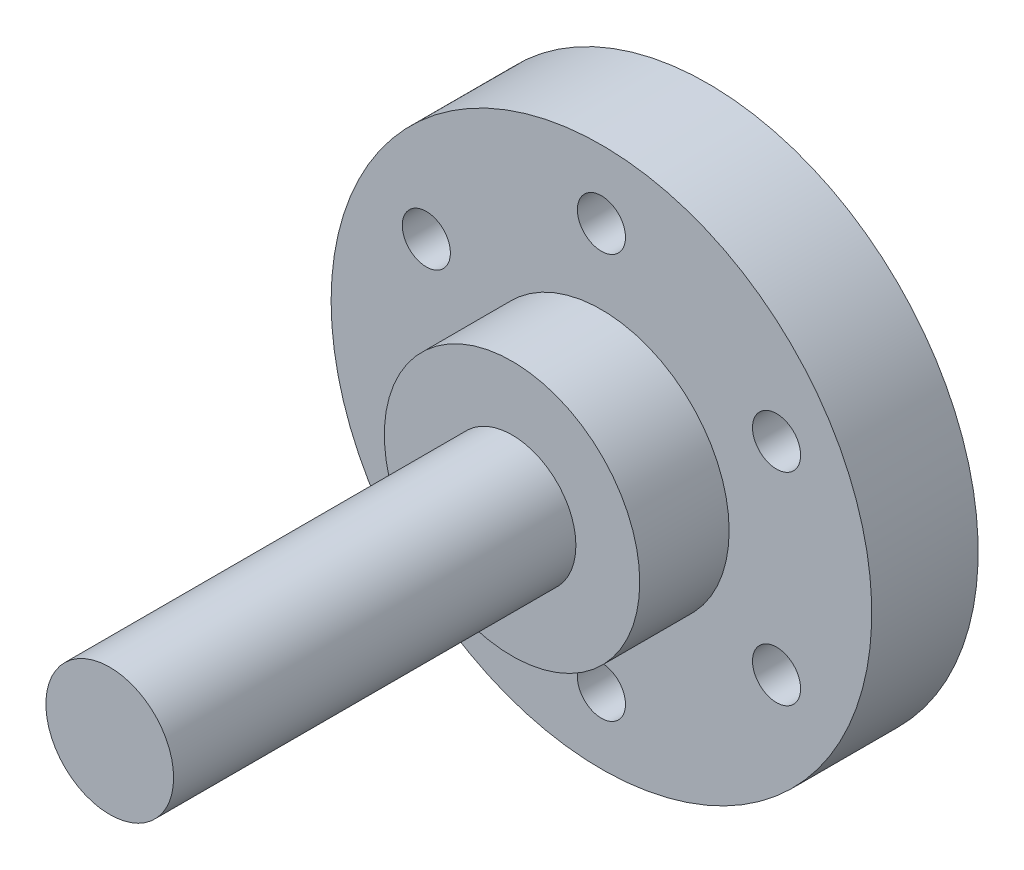
ISO-10303-21;
HEADER;
FILE_DESCRIPTION(('STEP AP214'),'2;1');
FILE_NAME('part.step','',(''),(''),'','','');
FILE_SCHEMA(('AUTOMOTIVE_DESIGN { 1 0 10303 214 1 1 1 1 }'));
ENDSEC;
DATA;
#1=APPLICATION_CONTEXT('core data for automotive mechanical design processes');
#2=APPLICATION_PROTOCOL_DEFINITION('international standard','automotive_design',2000,#1);
#3=PRODUCT_CONTEXT('',#1,'mechanical');
#4=PRODUCT('Part','Part','',(#3));
#5=PRODUCT_RELATED_PRODUCT_CATEGORY('part','',(#4));
#6=PRODUCT_DEFINITION_FORMATION('','',#4);
#7=PRODUCT_DEFINITION_CONTEXT('part definition',#1,'design');
#8=PRODUCT_DEFINITION('design','',#6,#7);
#9=PRODUCT_DEFINITION_SHAPE('','',#8);
#10=(LENGTH_UNIT() NAMED_UNIT(*) SI_UNIT(.MILLI.,.METRE.));
#11=(NAMED_UNIT(*) PLANE_ANGLE_UNIT() SI_UNIT($,.RADIAN.));
#12=(NAMED_UNIT(*) SI_UNIT($,.STERADIAN.) SOLID_ANGLE_UNIT());
#13=UNCERTAINTY_MEASURE_WITH_UNIT(LENGTH_MEASURE(1.E-05),#10,'distance_accuracy_value','');
#14=(GEOMETRIC_REPRESENTATION_CONTEXT(3) GLOBAL_UNCERTAINTY_ASSIGNED_CONTEXT((#13)) GLOBAL_UNIT_ASSIGNED_CONTEXT((#10,
#11,#12)) REPRESENTATION_CONTEXT('',''));
#15=CARTESIAN_POINT('',(0.,0.,0.));
#16=DIRECTION('',(0.,0.,1.));
#17=DIRECTION('',(1.,0.,0.));
#18=AXIS2_PLACEMENT_3D('',#15,#16,#17);
#19=CARTESIAN_POINT('',(0.,0.,5.9));
#20=DIRECTION('',(0.,0.,1.));
#21=DIRECTION('',(1.,0.,0.));
#22=AXIS2_PLACEMENT_3D('',#19,#20,#21);
#23=CYLINDRICAL_SURFACE('',#22,6.);
#24=CARTESIAN_POINT('',(0.,0.,5.9));
#25=DIRECTION('',(0.,0.,-1.));
#26=DIRECTION('',(-1.,0.,0.));
#27=AXIS2_PLACEMENT_3D('',#24,#25,#26);
#28=CIRCLE('',#27,6.);
#29=CARTESIAN_POINT('',(-6.,0.,5.9));
#30=VERTEX_POINT('',#29);
#31=EDGE_CURVE('E49',#30,#30,#28,.F.);
#32=ORIENTED_EDGE('',*,*,#31,.T.);
#33=EDGE_LOOP('',(#32));
#34=FACE_BOUND('',#33,.T.);
#35=CARTESIAN_POINT('',(0.,0.,10.1));
#36=DIRECTION('',(0.,0.,1.));
#37=DIRECTION('',(1.,0.,0.));
#38=AXIS2_PLACEMENT_3D('',#35,#36,#37);
#39=CIRCLE('',#38,6.);
#40=CARTESIAN_POINT('',(6.,0.,10.1));
#41=VERTEX_POINT('',#40);
#42=EDGE_CURVE('E58',#41,#41,#39,.T.);
#43=ORIENTED_EDGE('',*,*,#42,.F.);
#44=EDGE_LOOP('',(#43));
#45=FACE_BOUND('',#44,.T.);
#46=ADVANCED_FACE('F33',(#34,#45),#23,.T.);
#47=CARTESIAN_POINT('',(0.,0.,0.9));
#48=DIRECTION('',(0.,0.,-1.));
#49=DIRECTION('',(-1.,0.,0.));
#50=AXIS2_PLACEMENT_3D('',#47,#48,#49);
#51=PLANE('',#50);
#52=CARTESIAN_POINT('',(-8.22724133595237,4.75000000000035,0.899999999999998));
#53=DIRECTION('',(0.,0.,-1.));
#54=DIRECTION('',(-1.,0.,0.));
#55=AXIS2_PLACEMENT_3D('',#52,#53,#54);
#56=CIRCLE('',#55,1.13029999999999);
#57=CARTESIAN_POINT('',(-9.35754133595236,4.75000000000035,0.899999999999998));
#58=VERTEX_POINT('',#57);
#59=EDGE_CURVE('E170',#58,#58,#56,.T.);
#60=ORIENTED_EDGE('',*,*,#59,.F.);
#61=EDGE_LOOP('',(#60));
#62=FACE_BOUND('',#61,.T.);
#63=CARTESIAN_POINT('',(-8.22724133595277,-4.74999999999965,0.899999999999998));
#64=DIRECTION('',(0.,0.,-1.));
#65=DIRECTION('',(-1.,0.,0.));
#66=AXIS2_PLACEMENT_3D('',#63,#64,#65);
#67=CIRCLE('',#66,1.13029999999999);
#68=CARTESIAN_POINT('',(-9.35754133595276,-4.74999999999965,0.899999999999998));
#69=VERTEX_POINT('',#68);
#70=EDGE_CURVE('E81',#69,#69,#67,.T.);
#71=ORIENTED_EDGE('',*,*,#70,.F.);
#72=EDGE_LOOP('',(#71));
#73=FACE_BOUND('',#72,.T.);
#74=CARTESIAN_POINT('',(-8.07691889848134E-13,-9.5,0.899999999999998));
#75=DIRECTION('',(0.,0.,-1.));
#76=DIRECTION('',(-1.,0.,0.));
#77=AXIS2_PLACEMENT_3D('',#74,#75,#76);
#78=CIRCLE('',#77,1.13029999999999);
#79=CARTESIAN_POINT('',(-1.1303000000008,-9.5,0.899999999999998));
#80=VERTEX_POINT('',#79);
#81=EDGE_CURVE('E69',#80,#80,#78,.T.);
#82=ORIENTED_EDGE('',*,*,#81,.F.);
#83=EDGE_LOOP('',(#82));
#84=FACE_BOUND('',#83,.T.);
#85=CARTESIAN_POINT('',(8.22724133595156,-4.75000000000035,0.899999999999998));
#86=DIRECTION('',(0.,0.,-1.));
#87=DIRECTION('',(-1.,0.,0.));
#88=AXIS2_PLACEMENT_3D('',#85,#86,#87);
#89=CIRCLE('',#88,1.13029999999999);
#90=CARTESIAN_POINT('',(7.09694133595157,-4.75000000000035,0.899999999999998));
#91=VERTEX_POINT('',#90);
#92=EDGE_CURVE('E68',#91,#91,#89,.T.);
#93=ORIENTED_EDGE('',*,*,#92,.F.);
#94=EDGE_LOOP('',(#93));
#95=FACE_BOUND('',#94,.T.);
#96=CARTESIAN_POINT('',(8.22724133595197,4.74999999999964,0.899999999999998));
#97=DIRECTION('',(0.,0.,-1.));
#98=DIRECTION('',(-1.,0.,0.));
#99=AXIS2_PLACEMENT_3D('',#96,#97,#98);
#100=CIRCLE('',#99,1.13029999999999);
#101=CARTESIAN_POINT('',(7.09694133595198,4.74999999999964,0.899999999999998));
#102=VERTEX_POINT('',#101);
#103=EDGE_CURVE('E65',#102,#102,#100,.T.);
#104=ORIENTED_EDGE('',*,*,#103,.F.);
#105=EDGE_LOOP('',(#104));
#106=FACE_BOUND('',#105,.T.);
#107=CARTESIAN_POINT('',(0.,9.5,0.899999999999998));
#108=DIRECTION('',(0.,0.,-1.));
#109=DIRECTION('',(-1.,0.,0.));
#110=AXIS2_PLACEMENT_3D('',#107,#108,#109);
#111=CIRCLE('',#110,1.13029999999999);
#112=CARTESIAN_POINT('',(-1.13029999999999,9.5,0.899999999999998));
#113=VERTEX_POINT('',#112);
#114=EDGE_CURVE('E62',#113,#113,#111,.T.);
#115=ORIENTED_EDGE('',*,*,#114,.F.);
#116=EDGE_LOOP('',(#115));
#117=FACE_BOUND('',#116,.T.);
#118=CARTESIAN_POINT('',(0.,0.,0.9));
#119=DIRECTION('',(0.,0.,-1.));
#120=DIRECTION('',(-1.,0.,0.));
#121=AXIS2_PLACEMENT_3D('',#118,#119,#120);
#122=CIRCLE('',#121,12.7);
#123=CARTESIAN_POINT('',(-12.7,0.,0.9));
#124=VERTEX_POINT('',#123);
#125=EDGE_CURVE('E93',#124,#124,#122,.T.);
#126=ORIENTED_EDGE('',*,*,#125,.T.);
#127=EDGE_LOOP('',(#126));
#128=FACE_BOUND('',#127,.T.);
#129=CARTESIAN_POINT('',(0.,0.,0.900000000000001));
#130=DIRECTION('',(0.,0.,-1.));
#131=DIRECTION('',(-1.,0.,0.));
#132=AXIS2_PLACEMENT_3D('',#129,#130,#131);
#133=CIRCLE('',#132,3.);
#134=CARTESIAN_POINT('',(-3.,0.,0.900000000000001));
#135=VERTEX_POINT('',#134);
#136=EDGE_CURVE('E46',#135,#135,#133,.T.);
#137=ORIENTED_EDGE('',*,*,#136,.F.);
#138=EDGE_LOOP('',(#137));
#139=FACE_BOUND('',#138,.T.);
#140=ADVANCED_FACE('F111',(#62,#73,#84,#95,#106,#117,#128,#139),#51,.T.);
#141=CARTESIAN_POINT('',(0.,0.,0.9));
#142=DIRECTION('',(0.,0.,1.));
#143=DIRECTION('',(1.,0.,0.));
#144=AXIS2_PLACEMENT_3D('',#141,#142,#143);
#145=CYLINDRICAL_SURFACE('',#144,12.7);
#146=ORIENTED_EDGE('',*,*,#125,.F.);
#147=EDGE_LOOP('',(#146));
#148=FACE_BOUND('',#147,.T.);
#149=CARTESIAN_POINT('',(0.,0.,5.9));
#150=DIRECTION('',(0.,0.,-1.));
#151=DIRECTION('',(-1.,0.,0.));
#152=AXIS2_PLACEMENT_3D('',#149,#150,#151);
#153=CIRCLE('',#152,12.7);
#154=CARTESIAN_POINT('',(-12.7,0.,5.9));
#155=VERTEX_POINT('',#154);
#156=EDGE_CURVE('E57',#155,#155,#153,.T.);
#157=ORIENTED_EDGE('',*,*,#156,.T.);
#158=EDGE_LOOP('',(#157));
#159=FACE_BOUND('',#158,.T.);
#160=ADVANCED_FACE('F98',(#148,#159),#145,.T.);
#161=CARTESIAN_POINT('',(0.,0.,5.9));
#162=DIRECTION('',(0.,0.,-1.));
#163=DIRECTION('',(-1.,0.,0.));
#164=AXIS2_PLACEMENT_3D('',#161,#162,#163);
#165=PLANE('',#164);
#166=CARTESIAN_POINT('',(-8.22724133595237,4.75000000000035,5.9));
#167=DIRECTION('',(0.,0.,-1.));
#168=DIRECTION('',(-1.,0.,0.));
#169=AXIS2_PLACEMENT_3D('',#166,#167,#168);
#170=CIRCLE('',#169,1.13029999999999);
#171=CARTESIAN_POINT('',(-9.35754133595235,4.75000000000035,5.9));
#172=VERTEX_POINT('',#171);
#173=EDGE_CURVE('E37',#172,#172,#170,.T.);
#174=ORIENTED_EDGE('',*,*,#173,.T.);
#175=EDGE_LOOP('',(#174));
#176=FACE_BOUND('',#175,.T.);
#177=CARTESIAN_POINT('',(-8.22724133595277,-4.74999999999965,5.9));
#178=DIRECTION('',(0.,0.,-1.));
#179=DIRECTION('',(-1.,0.,0.));
#180=AXIS2_PLACEMENT_3D('',#177,#178,#179);
#181=CIRCLE('',#180,1.13029999999999);
#182=CARTESIAN_POINT('',(-9.35754133595276,-4.74999999999965,5.9));
#183=VERTEX_POINT('',#182);
#184=EDGE_CURVE('E76',#183,#183,#181,.T.);
#185=ORIENTED_EDGE('',*,*,#184,.T.);
#186=EDGE_LOOP('',(#185));
#187=FACE_BOUND('',#186,.T.);
#188=CARTESIAN_POINT('',(-8.07691889848134E-13,-9.5,5.9));
#189=DIRECTION('',(0.,0.,-1.));
#190=DIRECTION('',(-1.,0.,0.));
#191=AXIS2_PLACEMENT_3D('',#188,#189,#190);
#192=CIRCLE('',#191,1.13029999999999);
#193=CARTESIAN_POINT('',(-1.1303000000008,-9.5,5.9));
#194=VERTEX_POINT('',#193);
#195=EDGE_CURVE('E66',#194,#194,#192,.T.);
#196=ORIENTED_EDGE('',*,*,#195,.T.);
#197=EDGE_LOOP('',(#196));
#198=FACE_BOUND('',#197,.T.);
#199=CARTESIAN_POINT('',(8.22724133595156,-4.75000000000035,5.9));
#200=DIRECTION('',(0.,0.,-1.));
#201=DIRECTION('',(-1.,0.,0.));
#202=AXIS2_PLACEMENT_3D('',#199,#200,#201);
#203=CIRCLE('',#202,1.13029999999999);
#204=CARTESIAN_POINT('',(7.09694133595157,-4.75000000000035,5.9));
#205=VERTEX_POINT('',#204);
#206=EDGE_CURVE('E73',#205,#205,#203,.T.);
#207=ORIENTED_EDGE('',*,*,#206,.T.);
#208=EDGE_LOOP('',(#207));
#209=FACE_BOUND('',#208,.T.);
#210=CARTESIAN_POINT('',(8.22724133595197,4.74999999999964,5.9));
#211=DIRECTION('',(0.,0.,-1.));
#212=DIRECTION('',(-1.,0.,0.));
#213=AXIS2_PLACEMENT_3D('',#210,#211,#212);
#214=CIRCLE('',#213,1.13029999999999);
#215=CARTESIAN_POINT('',(7.09694133595198,4.74999999999964,5.9));
#216=VERTEX_POINT('',#215);
#217=EDGE_CURVE('E63',#216,#216,#214,.T.);
#218=ORIENTED_EDGE('',*,*,#217,.T.);
#219=EDGE_LOOP('',(#218));
#220=FACE_BOUND('',#219,.T.);
#221=CARTESIAN_POINT('',(0.,9.5,5.9));
#222=DIRECTION('',(0.,0.,-1.));
#223=DIRECTION('',(-1.,0.,0.));
#224=AXIS2_PLACEMENT_3D('',#221,#222,#223);
#225=CIRCLE('',#224,1.13029999999999);
#226=CARTESIAN_POINT('',(-1.13029999999999,9.5,5.9));
#227=VERTEX_POINT('',#226);
#228=EDGE_CURVE('E59',#227,#227,#225,.T.);
#229=ORIENTED_EDGE('',*,*,#228,.T.);
#230=EDGE_LOOP('',(#229));
#231=FACE_BOUND('',#230,.T.);
#232=ORIENTED_EDGE('',*,*,#31,.F.);
#233=EDGE_LOOP('',(#232));
#234=FACE_BOUND('',#233,.T.);
#235=ORIENTED_EDGE('',*,*,#156,.F.);
#236=EDGE_LOOP('',(#235));
#237=FACE_BOUND('',#236,.T.);
#238=ADVANCED_FACE('F100',(#176,#187,#198,#209,#220,#231,#234,#237),#165,.F.);
#239=CARTESIAN_POINT('',(0.,0.,0.));
#240=DIRECTION('',(0.,0.,1.));
#241=DIRECTION('',(1.,0.,0.));
#242=AXIS2_PLACEMENT_3D('',#239,#240,#241);
#243=PLANE('',#242);
#244=CARTESIAN_POINT('',(0.,0.,0.));
#245=DIRECTION('',(0.,0.,1.));
#246=DIRECTION('',(1.,0.,0.));
#247=AXIS2_PLACEMENT_3D('',#244,#245,#246);
#248=CIRCLE('',#247,3.);
#249=CARTESIAN_POINT('',(3.,0.,0.));
#250=VERTEX_POINT('',#249);
#251=EDGE_CURVE('E41',#250,#250,#248,.T.);
#252=ORIENTED_EDGE('',*,*,#251,.F.);
#253=EDGE_LOOP('',(#252));
#254=FACE_BOUND('',#253,.T.);
#255=ADVANCED_FACE('F102',(#254),#243,.F.);
#256=CARTESIAN_POINT('',(0.,0.,29.));
#257=DIRECTION('',(0.,0.,-1.));
#258=DIRECTION('',(-1.,0.,0.));
#259=AXIS2_PLACEMENT_3D('',#256,#257,#258);
#260=CYLINDRICAL_SURFACE('',#259,3.);
#261=ORIENTED_EDGE('',*,*,#136,.T.);
#262=EDGE_LOOP('',(#261));
#263=FACE_BOUND('',#262,.T.);
#264=ORIENTED_EDGE('',*,*,#251,.T.);
#265=EDGE_LOOP('',(#264));
#266=FACE_BOUND('',#265,.T.);
#267=ADVANCED_FACE('F109',(#263,#266),#260,.T.);
#268=CARTESIAN_POINT('',(0.,0.,10.1));
#269=DIRECTION('',(0.,0.,1.));
#270=DIRECTION('',(1.,0.,0.));
#271=AXIS2_PLACEMENT_3D('',#268,#269,#270);
#272=PLANE('',#271);
#273=ORIENTED_EDGE('',*,*,#42,.T.);
#274=EDGE_LOOP('',(#273));
#275=FACE_BOUND('',#274,.T.);
#276=CARTESIAN_POINT('',(0.,0.,10.1));
#277=DIRECTION('',(0.,0.,1.));
#278=DIRECTION('',(1.,0.,0.));
#279=AXIS2_PLACEMENT_3D('',#276,#277,#278);
#280=CIRCLE('',#279,3.);
#281=CARTESIAN_POINT('',(3.,0.,10.1));
#282=VERTEX_POINT('',#281);
#283=EDGE_CURVE('E54',#282,#282,#280,.T.);
#284=ORIENTED_EDGE('',*,*,#283,.F.);
#285=EDGE_LOOP('',(#284));
#286=FACE_BOUND('',#285,.T.);
#287=ADVANCED_FACE('F129',(#275,#286),#272,.T.);
#288=CARTESIAN_POINT('',(0.,0.,29.));
#289=DIRECTION('',(0.,0.,1.));
#290=DIRECTION('',(1.,0.,0.));
#291=AXIS2_PLACEMENT_3D('',#288,#289,#290);
#292=PLANE('',#291);
#293=CARTESIAN_POINT('',(0.,0.,29.));
#294=DIRECTION('',(0.,0.,1.));
#295=DIRECTION('',(1.,0.,0.));
#296=AXIS2_PLACEMENT_3D('',#293,#294,#295);
#297=CIRCLE('',#296,3.);
#298=CARTESIAN_POINT('',(3.,0.,29.));
#299=VERTEX_POINT('',#298);
#300=EDGE_CURVE('E10',#299,#299,#297,.T.);
#301=ORIENTED_EDGE('',*,*,#300,.T.);
#302=EDGE_LOOP('',(#301));
#303=FACE_BOUND('',#302,.T.);
#304=ADVANCED_FACE('F127',(#303),#292,.T.);
#305=ORIENTED_EDGE('',*,*,#283,.T.);
#306=EDGE_LOOP('',(#305));
#307=FACE_BOUND('',#306,.T.);
#308=ORIENTED_EDGE('',*,*,#300,.F.);
#309=EDGE_LOOP('',(#308));
#310=FACE_BOUND('',#309,.T.);
#311=ADVANCED_FACE('F35',(#307,#310),#260,.T.);
#312=CARTESIAN_POINT('',(0.,9.5,0.9));
#313=DIRECTION('',(0.,0.,-1.));
#314=DIRECTION('',(-1.,0.,0.));
#315=AXIS2_PLACEMENT_3D('',#312,#313,#314);
#316=CYLINDRICAL_SURFACE('',#315,1.13029999999999);
#317=ORIENTED_EDGE('',*,*,#114,.T.);
#318=EDGE_LOOP('',(#317));
#319=FACE_BOUND('',#318,.T.);
#320=ORIENTED_EDGE('',*,*,#228,.F.);
#321=EDGE_LOOP('',(#320));
#322=FACE_BOUND('',#321,.T.);
#323=ADVANCED_FACE('F134',(#319,#322),#316,.F.);
#324=CARTESIAN_POINT('',(8.22724133595197,4.74999999999964,0.9));
#325=DIRECTION('',(0.,0.,-1.));
#326=DIRECTION('',(-1.,0.,0.));
#327=AXIS2_PLACEMENT_3D('',#324,#325,#326);
#328=CYLINDRICAL_SURFACE('',#327,1.13029999999999);
#329=ORIENTED_EDGE('',*,*,#103,.T.);
#330=EDGE_LOOP('',(#329));
#331=FACE_BOUND('',#330,.T.);
#332=ORIENTED_EDGE('',*,*,#217,.F.);
#333=EDGE_LOOP('',(#332));
#334=FACE_BOUND('',#333,.T.);
#335=ADVANCED_FACE('F146',(#331,#334),#328,.F.);
#336=CARTESIAN_POINT('',(8.22724133595156,-4.75000000000035,0.9));
#337=DIRECTION('',(0.,0.,-1.));
#338=DIRECTION('',(-1.,0.,0.));
#339=AXIS2_PLACEMENT_3D('',#336,#337,#338);
#340=CYLINDRICAL_SURFACE('',#339,1.13029999999999);
#341=ORIENTED_EDGE('',*,*,#92,.T.);
#342=EDGE_LOOP('',(#341));
#343=FACE_BOUND('',#342,.T.);
#344=ORIENTED_EDGE('',*,*,#206,.F.);
#345=EDGE_LOOP('',(#344));
#346=FACE_BOUND('',#345,.T.);
#347=ADVANCED_FACE('F150',(#343,#346),#340,.F.);
#348=CARTESIAN_POINT('',(-8.07691889848134E-13,-9.5,0.9));
#349=DIRECTION('',(0.,0.,-1.));
#350=DIRECTION('',(-1.,0.,0.));
#351=AXIS2_PLACEMENT_3D('',#348,#349,#350);
#352=CYLINDRICAL_SURFACE('',#351,1.13029999999999);
#353=ORIENTED_EDGE('',*,*,#81,.T.);
#354=EDGE_LOOP('',(#353));
#355=FACE_BOUND('',#354,.T.);
#356=ORIENTED_EDGE('',*,*,#195,.F.);
#357=EDGE_LOOP('',(#356));
#358=FACE_BOUND('',#357,.T.);
#359=ADVANCED_FACE('F154',(#355,#358),#352,.F.);
#360=CARTESIAN_POINT('',(-8.22724133595277,-4.74999999999965,0.9));
#361=DIRECTION('',(0.,0.,-1.));
#362=DIRECTION('',(-1.,0.,0.));
#363=AXIS2_PLACEMENT_3D('',#360,#361,#362);
#364=CYLINDRICAL_SURFACE('',#363,1.13029999999999);
#365=ORIENTED_EDGE('',*,*,#70,.T.);
#366=EDGE_LOOP('',(#365));
#367=FACE_BOUND('',#366,.T.);
#368=ORIENTED_EDGE('',*,*,#184,.F.);
#369=EDGE_LOOP('',(#368));
#370=FACE_BOUND('',#369,.T.);
#371=ADVANCED_FACE('F158',(#367,#370),#364,.F.);
#372=CARTESIAN_POINT('',(-8.22724133595237,4.75000000000035,0.9));
#373=DIRECTION('',(0.,0.,-1.));
#374=DIRECTION('',(-1.,0.,0.));
#375=AXIS2_PLACEMENT_3D('',#372,#373,#374);
#376=CYLINDRICAL_SURFACE('',#375,1.13029999999999);
#377=ORIENTED_EDGE('',*,*,#59,.T.);
#378=EDGE_LOOP('',(#377));
#379=FACE_BOUND('',#378,.T.);
#380=ORIENTED_EDGE('',*,*,#173,.F.);
#381=EDGE_LOOP('',(#380));
#382=FACE_BOUND('',#381,.T.);
#383=ADVANCED_FACE('F161',(#379,#382),#376,.F.);
#384=CLOSED_SHELL('',(#46,#140,#160,#238,#255,#267,#287,#304,#311,#323,#335,#347,#359,#371,#383));
#385=MANIFOLD_SOLID_BREP('B2',#384);
#386=ADVANCED_BREP_SHAPE_REPRESENTATION('',(#18,#385),#14);
#387=SHAPE_DEFINITION_REPRESENTATION(#9,#386);
ENDSEC;
END-ISO-10303-21;
